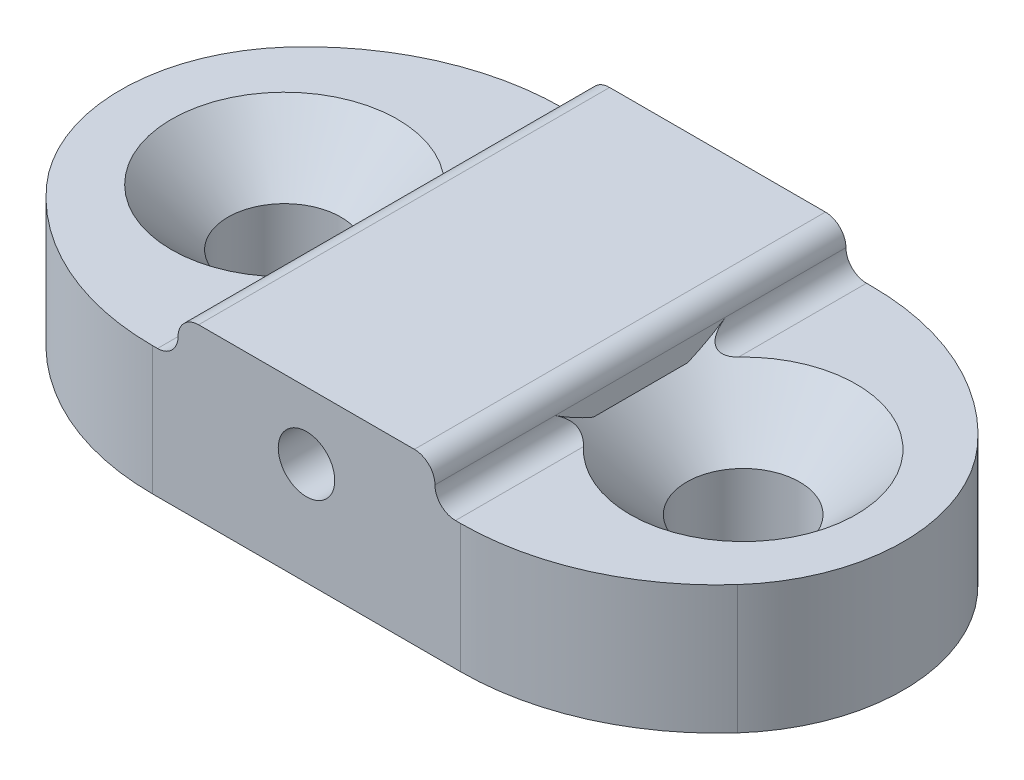
ISO-10303-21;
HEADER;
FILE_DESCRIPTION(('STEP AP214'),'2;1');
FILE_NAME('part.step','',(''),(''),'','','');
FILE_SCHEMA(('AUTOMOTIVE_DESIGN { 1 0 10303 214 1 1 1 1 }'));
ENDSEC;
DATA;
#1=APPLICATION_CONTEXT('core data for automotive mechanical design processes');
#2=APPLICATION_PROTOCOL_DEFINITION('international standard','automotive_design',2000,#1);
#3=PRODUCT_CONTEXT('',#1,'mechanical');
#4=PRODUCT('Part','Part','',(#3));
#5=PRODUCT_RELATED_PRODUCT_CATEGORY('part','',(#4));
#6=PRODUCT_DEFINITION_FORMATION('','',#4);
#7=PRODUCT_DEFINITION_CONTEXT('part definition',#1,'design');
#8=PRODUCT_DEFINITION('design','',#6,#7);
#9=PRODUCT_DEFINITION_SHAPE('','',#8);
#10=(LENGTH_UNIT() NAMED_UNIT(*) SI_UNIT(.MILLI.,.METRE.));
#11=(NAMED_UNIT(*) PLANE_ANGLE_UNIT() SI_UNIT($,.RADIAN.));
#12=(NAMED_UNIT(*) SI_UNIT($,.STERADIAN.) SOLID_ANGLE_UNIT());
#13=UNCERTAINTY_MEASURE_WITH_UNIT(LENGTH_MEASURE(1.E-05),#10,'distance_accuracy_value','');
#14=(GEOMETRIC_REPRESENTATION_CONTEXT(3) GLOBAL_UNCERTAINTY_ASSIGNED_CONTEXT((#13)) GLOBAL_UNIT_ASSIGNED_CONTEXT((#10,
#11,#12)) REPRESENTATION_CONTEXT('',''));
#15=CARTESIAN_POINT('',(0.,0.,0.));
#16=DIRECTION('',(0.,0.,1.));
#17=DIRECTION('',(1.,0.,0.));
#18=AXIS2_PLACEMENT_3D('',#15,#16,#17);
#19=CARTESIAN_POINT('',(0.,2.5,0.));
#20=DIRECTION('',(0.,-1.,0.));
#21=DIRECTION('',(0.,0.,-1.));
#22=AXIS2_PLACEMENT_3D('',#19,#20,#21);
#23=PLANE('',#22);
#24=CARTESIAN_POINT('',(5.,2.5,-3.));
#25=DIRECTION('',(0.,-1.,0.));
#26=DIRECTION('',(0.,0.,-1.));
#27=AXIS2_PLACEMENT_3D('',#24,#25,#26);
#28=CIRCLE('',#27,5.);
#29=CARTESIAN_POINT('',(5.,2.5,-8.));
#30=VERTEX_POINT('',#29);
#31=CARTESIAN_POINT('',(1.27322003750035,2.5,-6.33333333333333));
#32=VERTEX_POINT('',#31);
#33=EDGE_CURVE('E378',#30,#32,#28,.F.);
#34=ORIENTED_EDGE('',*,*,#33,.T.);
#35=CARTESIAN_POINT('',(3.88196601125011,2.5,-4.));
#36=DIRECTION('',(0.,-1.,0.));
#37=DIRECTION('',(0.,0.,-1.));
#38=AXIS2_PLACEMENT_3D('',#35,#36,#37);
#39=CIRCLE('',#38,3.5);
#40=CARTESIAN_POINT('',(1.27322003750035,2.5,-1.66666666666667));
#41=VERTEX_POINT('',#40);
#42=EDGE_CURVE('E383',#32,#41,#39,.F.);
#43=ORIENTED_EDGE('',*,*,#42,.T.);
#44=CARTESIAN_POINT('',(5.,2.5,-5.));
#45=DIRECTION('',(0.,-1.,0.));
#46=DIRECTION('',(0.,0.,-1.));
#47=AXIS2_PLACEMENT_3D('',#44,#45,#46);
#48=CIRCLE('',#47,5.);
#49=CARTESIAN_POINT('',(5.,2.5,0.));
#50=VERTEX_POINT('',#49);
#51=EDGE_CURVE('E376',#41,#50,#48,.F.);
#52=ORIENTED_EDGE('',*,*,#51,.T.);
#53=DIRECTION('',(1.,0.,0.));
#54=VECTOR('',#53,1.);
#55=CARTESIAN_POINT('',(0.,2.5,0.));
#56=LINE('',#55,#54);
#57=CARTESIAN_POINT('',(5.1,2.5,0.));
#58=VERTEX_POINT('',#57);
#59=EDGE_CURVE('E215',#50,#58,#56,.T.);
#60=ORIENTED_EDGE('',*,*,#59,.T.);
#61=DIRECTION('',(0.,0.,1.));
#62=VECTOR('',#61,1.);
#63=CARTESIAN_POINT('',(5.1,2.5,0.));
#64=LINE('',#63,#62);
#65=CARTESIAN_POINT('',(5.1,2.5,-2.41808901716345));
#66=VERTEX_POINT('',#65);
#67=EDGE_CURVE('E266',#58,#66,#64,.F.);
#68=ORIENTED_EDGE('',*,*,#67,.T.);
#69=CARTESIAN_POINT('',(3.57109266389977,2.5,-4.));
#70=DIRECTION('',(0.,1.,0.));
#71=DIRECTION('',(0.,0.,1.));
#72=AXIS2_PLACEMENT_3D('',#69,#70,#71);
#73=CIRCLE('',#72,2.2);
#74=CARTESIAN_POINT('',(5.1,2.5,-5.58191098283655));
#75=VERTEX_POINT('',#74);
#76=EDGE_CURVE('E430',#75,#66,#73,.T.);
#77=ORIENTED_EDGE('',*,*,#76,.F.);
#78=DIRECTION('',(0.,0.,1.));
#79=VECTOR('',#78,1.);
#80=CARTESIAN_POINT('',(5.1,2.5,0.));
#81=LINE('',#80,#79);
#82=CARTESIAN_POINT('',(5.1,2.5,-8.));
#83=VERTEX_POINT('',#82);
#84=EDGE_CURVE('E478',#75,#83,#81,.F.);
#85=ORIENTED_EDGE('',*,*,#84,.T.);
#86=DIRECTION('',(-1.,0.,0.));
#87=VECTOR('',#86,1.);
#88=CARTESIAN_POINT('',(0.,2.5,-8.));
#89=LINE('',#88,#87);
#90=EDGE_CURVE('E217',#83,#30,#89,.T.);
#91=ORIENTED_EDGE('',*,*,#90,.T.);
#92=EDGE_LOOP('',(#34,#43,#52,#60,#68,#77,#85,#91));
#93=FACE_BOUND('',#92,.T.);
#94=ADVANCED_FACE('F33',(#93),#23,.F.);
#95=CARTESIAN_POINT('',(0.,2.5,0.));
#96=DIRECTION('',(0.,0.,-1.));
#97=DIRECTION('',(-1.,0.,0.));
#98=AXIS2_PLACEMENT_3D('',#95,#96,#97);
#99=PLANE('',#98);
#100=CARTESIAN_POINT('',(8.,2.,0.));
#101=DIRECTION('',(0.,0.,-1.));
#102=DIRECTION('',(-1.,0.,0.));
#103=AXIS2_PLACEMENT_3D('',#100,#101,#102);
#104=CIRCLE('',#103,0.55);
#105=CARTESIAN_POINT('',(7.45,2.,0.));
#106=VERTEX_POINT('',#105);
#107=EDGE_CURVE('E204',#106,#106,#104,.T.);
#108=ORIENTED_EDGE('',*,*,#107,.T.);
#109=EDGE_LOOP('',(#108));
#110=FACE_BOUND('',#109,.T.);
#111=DIRECTION('',(1.,0.,0.));
#112=VECTOR('',#111,1.);
#113=CARTESIAN_POINT('',(0.,0.,0.));
#114=LINE('',#113,#112);
#115=CARTESIAN_POINT('',(5.,0.,0.));
#116=VERTEX_POINT('',#115);
#117=CARTESIAN_POINT('',(11.,0.,0.));
#118=VERTEX_POINT('',#117);
#119=EDGE_CURVE('E210',#116,#118,#114,.T.);
#120=ORIENTED_EDGE('',*,*,#119,.T.);
#121=DIRECTION('',(0.,-1.,0.));
#122=VECTOR('',#121,1.);
#123=CARTESIAN_POINT('',(11.,2.5,0.));
#124=LINE('',#123,#122);
#125=CARTESIAN_POINT('',(11.,2.5,0.));
#126=VERTEX_POINT('',#125);
#127=EDGE_CURVE('E371',#118,#126,#124,.F.);
#128=ORIENTED_EDGE('',*,*,#127,.T.);
#129=CARTESIAN_POINT('',(10.9,2.5,0.));
#130=VERTEX_POINT('',#129);
#131=EDGE_CURVE('E218',#130,#126,#56,.T.);
#132=ORIENTED_EDGE('',*,*,#131,.F.);
#133=CARTESIAN_POINT('',(10.9,2.9,0.));
#134=DIRECTION('',(0.,0.,-1.));
#135=DIRECTION('',(-1.,0.,0.));
#136=AXIS2_PLACEMENT_3D('',#133,#134,#135);
#137=CIRCLE('',#136,0.4);
#138=CARTESIAN_POINT('',(10.5,2.9,0.));
#139=VERTEX_POINT('',#138);
#140=EDGE_CURVE('E296',#130,#139,#137,.T.);
#141=ORIENTED_EDGE('',*,*,#140,.T.);
#142=CARTESIAN_POINT('',(10.1,2.9,0.));
#143=DIRECTION('',(0.,0.,-1.));
#144=DIRECTION('',(-1.,0.,0.));
#145=AXIS2_PLACEMENT_3D('',#142,#143,#144);
#146=CIRCLE('',#145,0.4);
#147=CARTESIAN_POINT('',(10.1,3.3,0.));
#148=VERTEX_POINT('',#147);
#149=EDGE_CURVE('E441',#139,#148,#146,.F.);
#150=ORIENTED_EDGE('',*,*,#149,.T.);
#151=DIRECTION('',(-1.,0.,0.));
#152=VECTOR('',#151,1.);
#153=CARTESIAN_POINT('',(5.5,3.3,0.));
#154=LINE('',#153,#152);
#155=CARTESIAN_POINT('',(5.9,3.3,0.));
#156=VERTEX_POINT('',#155);
#157=EDGE_CURVE('E207',#148,#156,#154,.T.);
#158=ORIENTED_EDGE('',*,*,#157,.T.);
#159=CARTESIAN_POINT('',(5.9,2.9,0.));
#160=DIRECTION('',(0.,0.,-1.));
#161=DIRECTION('',(-1.,0.,0.));
#162=AXIS2_PLACEMENT_3D('',#159,#160,#161);
#163=CIRCLE('',#162,0.4);
#164=CARTESIAN_POINT('',(5.5,2.9,0.));
#165=VERTEX_POINT('',#164);
#166=EDGE_CURVE('E448',#156,#165,#163,.F.);
#167=ORIENTED_EDGE('',*,*,#166,.T.);
#168=CARTESIAN_POINT('',(5.1,2.9,0.));
#169=DIRECTION('',(0.,0.,-1.));
#170=DIRECTION('',(-1.,0.,0.));
#171=AXIS2_PLACEMENT_3D('',#168,#169,#170);
#172=CIRCLE('',#171,0.4);
#173=EDGE_CURVE('E295',#165,#58,#172,.T.);
#174=ORIENTED_EDGE('',*,*,#173,.T.);
#175=ORIENTED_EDGE('',*,*,#59,.F.);
#176=DIRECTION('',(0.,-1.,0.));
#177=VECTOR('',#176,1.);
#178=CARTESIAN_POINT('',(5.,2.5,0.));
#179=LINE('',#178,#177);
#180=EDGE_CURVE('E405',#50,#116,#179,.T.);
#181=ORIENTED_EDGE('',*,*,#180,.T.);
#182=EDGE_LOOP('',(#120,#128,#132,#141,#150,#158,#167,#174,#175,#181));
#183=FACE_BOUND('',#182,.T.);
#184=ADVANCED_FACE('F277',(#110,#183),#99,.F.);
#185=CARTESIAN_POINT('',(0.,2.5,-8.));
#186=DIRECTION('',(0.,0.,1.));
#187=DIRECTION('',(1.,0.,0.));
#188=AXIS2_PLACEMENT_3D('',#185,#186,#187);
#189=PLANE('',#188);
#190=CARTESIAN_POINT('',(8.,2.,-8.));
#191=DIRECTION('',(0.,0.,1.));
#192=DIRECTION('',(1.,0.,0.));
#193=AXIS2_PLACEMENT_3D('',#190,#191,#192);
#194=CIRCLE('',#193,0.55);
#195=CARTESIAN_POINT('',(8.55,2.,-8.));
#196=VERTEX_POINT('',#195);
#197=EDGE_CURVE('E201',#196,#196,#194,.T.);
#198=ORIENTED_EDGE('',*,*,#197,.T.);
#199=EDGE_LOOP('',(#198));
#200=FACE_BOUND('',#199,.T.);
#201=CARTESIAN_POINT('',(11.,2.5,-8.));
#202=VERTEX_POINT('',#201);
#203=CARTESIAN_POINT('',(10.9,2.5,-8.));
#204=VERTEX_POINT('',#203);
#205=EDGE_CURVE('E219',#202,#204,#89,.T.);
#206=ORIENTED_EDGE('',*,*,#205,.F.);
#207=DIRECTION('',(0.,-1.,0.));
#208=VECTOR('',#207,1.);
#209=CARTESIAN_POINT('',(11.,2.5,-8.));
#210=LINE('',#209,#208);
#211=CARTESIAN_POINT('',(11.,0.,-8.));
#212=VERTEX_POINT('',#211);
#213=EDGE_CURVE('E369',#202,#212,#210,.T.);
#214=ORIENTED_EDGE('',*,*,#213,.T.);
#215=DIRECTION('',(-1.,0.,0.));
#216=VECTOR('',#215,1.);
#217=CARTESIAN_POINT('',(0.,0.,-8.));
#218=LINE('',#217,#216);
#219=CARTESIAN_POINT('',(5.,0.,-8.));
#220=VERTEX_POINT('',#219);
#221=EDGE_CURVE('E224',#212,#220,#218,.T.);
#222=ORIENTED_EDGE('',*,*,#221,.T.);
#223=DIRECTION('',(0.,-1.,0.));
#224=VECTOR('',#223,1.);
#225=CARTESIAN_POINT('',(5.,2.5,-8.));
#226=LINE('',#225,#224);
#227=EDGE_CURVE('E365',#220,#30,#226,.F.);
#228=ORIENTED_EDGE('',*,*,#227,.T.);
#229=ORIENTED_EDGE('',*,*,#90,.F.);
#230=CARTESIAN_POINT('',(5.1,2.9,-8.));
#231=DIRECTION('',(0.,0.,1.));
#232=DIRECTION('',(1.,0.,0.));
#233=AXIS2_PLACEMENT_3D('',#230,#231,#232);
#234=CIRCLE('',#233,0.4);
#235=CARTESIAN_POINT('',(5.5,2.9,-8.));
#236=VERTEX_POINT('',#235);
#237=EDGE_CURVE('E418',#83,#236,#234,.T.);
#238=ORIENTED_EDGE('',*,*,#237,.T.);
#239=CARTESIAN_POINT('',(5.9,2.9,-8.));
#240=DIRECTION('',(0.,0.,1.));
#241=DIRECTION('',(1.,0.,0.));
#242=AXIS2_PLACEMENT_3D('',#239,#240,#241);
#243=CIRCLE('',#242,0.4);
#244=CARTESIAN_POINT('',(5.9,3.3,-8.));
#245=VERTEX_POINT('',#244);
#246=EDGE_CURVE('E456',#236,#245,#243,.F.);
#247=ORIENTED_EDGE('',*,*,#246,.T.);
#248=DIRECTION('',(1.,0.,0.));
#249=VECTOR('',#248,1.);
#250=CARTESIAN_POINT('',(5.5,3.3,-8.));
#251=LINE('',#250,#249);
#252=CARTESIAN_POINT('',(10.1,3.3,-8.));
#253=VERTEX_POINT('',#252);
#254=EDGE_CURVE('E184',#245,#253,#251,.T.);
#255=ORIENTED_EDGE('',*,*,#254,.T.);
#256=CARTESIAN_POINT('',(10.1,2.9,-8.));
#257=DIRECTION('',(0.,0.,1.));
#258=DIRECTION('',(1.,0.,0.));
#259=AXIS2_PLACEMENT_3D('',#256,#257,#258);
#260=CIRCLE('',#259,0.4);
#261=CARTESIAN_POINT('',(10.5,2.9,-8.));
#262=VERTEX_POINT('',#261);
#263=EDGE_CURVE('E438',#253,#262,#260,.F.);
#264=ORIENTED_EDGE('',*,*,#263,.T.);
#265=CARTESIAN_POINT('',(10.9,2.9,-8.));
#266=DIRECTION('',(0.,0.,1.));
#267=DIRECTION('',(1.,0.,0.));
#268=AXIS2_PLACEMENT_3D('',#265,#266,#267);
#269=CIRCLE('',#268,0.4);
#270=EDGE_CURVE('E265',#262,#204,#269,.T.);
#271=ORIENTED_EDGE('',*,*,#270,.T.);
#272=EDGE_LOOP('',(#206,#214,#222,#228,#229,#238,#247,#255,#264,#271));
#273=FACE_BOUND('',#272,.T.);
#274=ADVANCED_FACE('F347',(#200,#273),#189,.F.);
#275=CARTESIAN_POINT('',(11.,2.5,-5.));
#276=DIRECTION('',(0.,-1.,0.));
#277=DIRECTION('',(0.,0.,-1.));
#278=AXIS2_PLACEMENT_3D('',#275,#276,#277);
#279=CIRCLE('',#278,5.);
#280=CARTESIAN_POINT('',(14.7267799624996,2.5,-1.66666666666667));
#281=VERTEX_POINT('',#280);
#282=EDGE_CURVE('E361',#126,#281,#279,.F.);
#283=ORIENTED_EDGE('',*,*,#282,.T.);
#284=CARTESIAN_POINT('',(12.1180339887499,2.5,-4.));
#285=DIRECTION('',(0.,-1.,0.));
#286=DIRECTION('',(0.,0.,-1.));
#287=AXIS2_PLACEMENT_3D('',#284,#285,#286);
#288=CIRCLE('',#287,3.5);
#289=CARTESIAN_POINT('',(14.7267799624996,2.5,-6.33333333333333));
#290=VERTEX_POINT('',#289);
#291=EDGE_CURVE('E41',#281,#290,#288,.F.);
#292=ORIENTED_EDGE('',*,*,#291,.T.);
#293=CARTESIAN_POINT('',(11.,2.5,-3.));
#294=DIRECTION('',(0.,-1.,0.));
#295=DIRECTION('',(0.,0.,-1.));
#296=AXIS2_PLACEMENT_3D('',#293,#294,#295);
#297=CIRCLE('',#296,5.);
#298=EDGE_CURVE('E366',#290,#202,#297,.F.);
#299=ORIENTED_EDGE('',*,*,#298,.T.);
#300=ORIENTED_EDGE('',*,*,#205,.T.);
#301=DIRECTION('',(0.,0.,1.));
#302=VECTOR('',#301,1.);
#303=CARTESIAN_POINT('',(10.9,2.5,0.));
#304=LINE('',#303,#302);
#305=CARTESIAN_POINT('',(10.9,2.5,-5.50996688705415));
#306=VERTEX_POINT('',#305);
#307=EDGE_CURVE('E228',#204,#306,#304,.T.);
#308=ORIENTED_EDGE('',*,*,#307,.T.);
#309=CARTESIAN_POINT('',(12.5,2.5,-4.));
#310=DIRECTION('',(0.,1.,0.));
#311=DIRECTION('',(0.,0.,1.));
#312=AXIS2_PLACEMENT_3D('',#309,#310,#311);
#313=CIRCLE('',#312,2.2);
#314=CARTESIAN_POINT('',(10.9,2.5,-2.49003311294585));
#315=VERTEX_POINT('',#314);
#316=EDGE_CURVE('E189',#315,#306,#313,.T.);
#317=ORIENTED_EDGE('',*,*,#316,.F.);
#318=DIRECTION('',(0.,0.,1.));
#319=VECTOR('',#318,1.);
#320=CARTESIAN_POINT('',(10.9,2.5,0.));
#321=LINE('',#320,#319);
#322=EDGE_CURVE('E221',#315,#130,#321,.T.);
#323=ORIENTED_EDGE('',*,*,#322,.T.);
#324=ORIENTED_EDGE('',*,*,#131,.T.);
#325=EDGE_LOOP('',(#283,#292,#299,#300,#308,#317,#323,#324));
#326=FACE_BOUND('',#325,.T.);
#327=ADVANCED_FACE('F343',(#326),#23,.F.);
#328=CARTESIAN_POINT('',(0.,0.,0.));
#329=DIRECTION('',(0.,-1.,0.));
#330=DIRECTION('',(0.,0.,-1.));
#331=AXIS2_PLACEMENT_3D('',#328,#329,#330);
#332=PLANE('',#331);
#333=CARTESIAN_POINT('',(3.57109266389977,0.,-4.));
#334=DIRECTION('',(0.,1.,0.));
#335=DIRECTION('',(0.,0.,1.));
#336=AXIS2_PLACEMENT_3D('',#333,#334,#335);
#337=CIRCLE('',#336,1.1);
#338=CARTESIAN_POINT('',(3.57109266389977,0.,-2.9));
#339=VERTEX_POINT('',#338);
#340=EDGE_CURVE('E195',#339,#339,#337,.T.);
#341=ORIENTED_EDGE('',*,*,#340,.T.);
#342=EDGE_LOOP('',(#341));
#343=FACE_BOUND('',#342,.T.);
#344=CARTESIAN_POINT('',(12.5,0.,-4.));
#345=DIRECTION('',(0.,1.,0.));
#346=DIRECTION('',(0.,0.,1.));
#347=AXIS2_PLACEMENT_3D('',#344,#345,#346);
#348=CIRCLE('',#347,1.1);
#349=CARTESIAN_POINT('',(12.5,0.,-2.9));
#350=VERTEX_POINT('',#349);
#351=EDGE_CURVE('E192',#350,#350,#348,.T.);
#352=ORIENTED_EDGE('',*,*,#351,.T.);
#353=EDGE_LOOP('',(#352));
#354=FACE_BOUND('',#353,.T.);
#355=CARTESIAN_POINT('',(5.,0.,-5.));
#356=DIRECTION('',(0.,-1.,0.));
#357=DIRECTION('',(0.,0.,-1.));
#358=AXIS2_PLACEMENT_3D('',#355,#356,#357);
#359=CIRCLE('',#358,5.);
#360=CARTESIAN_POINT('',(1.27322003750035,0.,-1.66666666666667));
#361=VERTEX_POINT('',#360);
#362=EDGE_CURVE('E407',#116,#361,#359,.T.);
#363=ORIENTED_EDGE('',*,*,#362,.T.);
#364=CARTESIAN_POINT('',(3.88196601125011,0.,-4.));
#365=DIRECTION('',(0.,-1.,0.));
#366=DIRECTION('',(0.,0.,-1.));
#367=AXIS2_PLACEMENT_3D('',#364,#365,#366);
#368=CIRCLE('',#367,3.5);
#369=CARTESIAN_POINT('',(1.27322003750035,0.,-6.33333333333333));
#370=VERTEX_POINT('',#369);
#371=EDGE_CURVE('E389',#361,#370,#368,.T.);
#372=ORIENTED_EDGE('',*,*,#371,.T.);
#373=CARTESIAN_POINT('',(5.,0.,-3.));
#374=DIRECTION('',(0.,-1.,0.));
#375=DIRECTION('',(0.,0.,-1.));
#376=AXIS2_PLACEMENT_3D('',#373,#374,#375);
#377=CIRCLE('',#376,5.);
#378=EDGE_CURVE('E403',#370,#220,#377,.T.);
#379=ORIENTED_EDGE('',*,*,#378,.T.);
#380=ORIENTED_EDGE('',*,*,#221,.F.);
#381=CARTESIAN_POINT('',(11.,0.,-3.));
#382=DIRECTION('',(0.,-1.,0.));
#383=DIRECTION('',(0.,0.,-1.));
#384=AXIS2_PLACEMENT_3D('',#381,#382,#383);
#385=CIRCLE('',#384,5.);
#386=CARTESIAN_POINT('',(14.7267799624996,0.,-6.33333333333333));
#387=VERTEX_POINT('',#386);
#388=EDGE_CURVE('E401',#212,#387,#385,.T.);
#389=ORIENTED_EDGE('',*,*,#388,.T.);
#390=CARTESIAN_POINT('',(12.1180339887499,0.,-4.));
#391=DIRECTION('',(0.,-1.,0.));
#392=DIRECTION('',(0.,0.,-1.));
#393=AXIS2_PLACEMENT_3D('',#390,#391,#392);
#394=CIRCLE('',#393,3.5);
#395=CARTESIAN_POINT('',(14.7267799624996,0.,-1.66666666666667));
#396=VERTEX_POINT('',#395);
#397=EDGE_CURVE('E387',#387,#396,#394,.T.);
#398=ORIENTED_EDGE('',*,*,#397,.T.);
#399=CARTESIAN_POINT('',(11.,0.,-5.));
#400=DIRECTION('',(0.,-1.,0.));
#401=DIRECTION('',(0.,0.,-1.));
#402=AXIS2_PLACEMENT_3D('',#399,#400,#401);
#403=CIRCLE('',#402,5.);
#404=EDGE_CURVE('E393',#396,#118,#403,.T.);
#405=ORIENTED_EDGE('',*,*,#404,.T.);
#406=ORIENTED_EDGE('',*,*,#119,.F.);
#407=EDGE_LOOP('',(#363,#372,#379,#380,#389,#398,#405,#406));
#408=FACE_BOUND('',#407,.T.);
#409=ADVANCED_FACE('F352',(#343,#354,#408),#332,.T.);
#410=CARTESIAN_POINT('',(5.5,2.5,-13.0635955604689));
#411=DIRECTION('',(-1.,0.,0.));
#412=DIRECTION('',(0.,-1.,0.));
#413=AXIS2_PLACEMENT_3D('',#410,#411,#412);
#414=PLANE('',#413);
#415=DIRECTION('',(0.,0.,1.));
#416=VECTOR('',#415,1.);
#417=CARTESIAN_POINT('',(5.5,2.5,-13.0635955604689));
#418=LINE('',#417,#416);
#419=CARTESIAN_POINT('',(5.5,2.5,-5.05797754642463));
#420=VERTEX_POINT('',#419);
#421=CARTESIAN_POINT('',(5.5,2.5,-2.94202245357536));
#422=VERTEX_POINT('',#421);
#423=EDGE_CURVE('E185',#420,#422,#418,.T.);
#424=ORIENTED_EDGE('',*,*,#423,.T.);
#425=CARTESIAN_POINT('',(5.5,2.5,-2.94202245357536));
#426=CARTESIAN_POINT('',(5.5,2.52872917775644,-2.8823228496387));
#427=CARTESIAN_POINT('',(5.5,2.55893294478922,-2.82335937948788));
#428=CARTESIAN_POINT('',(5.5,2.62175738827018,-2.70682487240755));
#429=CARTESIAN_POINT('',(5.5,2.6543750152887,-2.64925219651247));
#430=CARTESIAN_POINT('',(5.5,2.72155791669848,-2.53529023365637));
#431=CARTESIAN_POINT('',(5.5,2.75612255971361,-2.47890057111754));
#432=CARTESIAN_POINT('',(5.5,2.82691084229986,-2.36707219379437));
#433=CARTESIAN_POINT('',(5.5,2.86313648702678,-2.31163474568505));
#434=CARTESIAN_POINT('',(5.5,2.90000000000016,-2.25663644389946));
#435=B_SPLINE_CURVE_WITH_KNOTS('',3,(#425,#426,#427,#428,#429,#430,#431,#432,#433,#434),
.UNSPECIFIED.,.F.,.F.,(4,2,2,2,4),(0.,0.198703135537779,0.397159399098888,0.595551673880541,
0.794190099681815),.UNSPECIFIED.);
#436=CARTESIAN_POINT('',(5.5,2.9,-2.25663644389938));
#437=VERTEX_POINT('',#436);
#438=EDGE_CURVE('E473',#422,#437,#435,.T.);
#439=ORIENTED_EDGE('',*,*,#438,.T.);
#440=DIRECTION('',(0.,0.,1.));
#441=VECTOR('',#440,1.);
#442=CARTESIAN_POINT('',(5.5,2.9,-13.0635955604689));
#443=LINE('',#442,#441);
#444=CARTESIAN_POINT('',(5.5,2.9,-5.74336355610062));
#445=VERTEX_POINT('',#444);
#446=EDGE_CURVE('E467',#437,#445,#443,.F.);
#447=ORIENTED_EDGE('',*,*,#446,.T.);
#448=CARTESIAN_POINT('',(5.5,2.9,-5.74336355610062));
#449=CARTESIAN_POINT('',(5.5,2.86313648702672,-5.68836525431496));
#450=CARTESIAN_POINT('',(5.5,2.82691084229984,-5.63292780620562));
#451=CARTESIAN_POINT('',(5.5,2.75612255971362,-5.52109942888244));
#452=CARTESIAN_POINT('',(5.5,2.72155791669848,-5.46470976634362));
#453=CARTESIAN_POINT('',(5.5,2.65437501528869,-5.35074780348753));
#454=CARTESIAN_POINT('',(5.5,2.62175738827018,-5.29317512759244));
#455=CARTESIAN_POINT('',(5.5,2.55893294478922,-5.17664062051212));
#456=CARTESIAN_POINT('',(5.5,2.52872917775644,-5.11767715036129));
#457=CARTESIAN_POINT('',(5.5,2.5,-5.05797754642463));
#458=B_SPLINE_CURVE_WITH_KNOTS('',3,(#448,#449,#450,#451,#452,#453,#454,#455,#456,#457),
.UNSPECIFIED.,.F.,.F.,(4,2,2,2,4),(0.,0.198638425801267,0.397030700582914,0.595486964144023,
0.794190099681799),.UNSPECIFIED.);
#459=EDGE_CURVE('E462',#445,#420,#458,.T.);
#460=ORIENTED_EDGE('',*,*,#459,.T.);
#461=EDGE_LOOP('',(#424,#439,#447,#460));
#462=FACE_BOUND('',#461,.T.);
#463=ADVANCED_FACE('F357',(#462),#414,.T.);
#464=CARTESIAN_POINT('',(5.5,3.3,-13.0635955604689));
#465=DIRECTION('',(0.,1.,0.));
#466=DIRECTION('',(-1.,0.,0.));
#467=AXIS2_PLACEMENT_3D('',#464,#465,#466);
#468=PLANE('',#467);
#469=ORIENTED_EDGE('',*,*,#157,.F.);
#470=DIRECTION('',(0.,0.,1.));
#471=VECTOR('',#470,1.);
#472=CARTESIAN_POINT('',(10.1,3.3,-13.0635955604689));
#473=LINE('',#472,#471);
#474=EDGE_CURVE('E454',#148,#253,#473,.F.);
#475=ORIENTED_EDGE('',*,*,#474,.T.);
#476=ORIENTED_EDGE('',*,*,#254,.F.);
#477=DIRECTION('',(0.,0.,1.));
#478=VECTOR('',#477,1.);
#479=CARTESIAN_POINT('',(5.9,3.3,-13.0635955604689));
#480=LINE('',#479,#478);
#481=EDGE_CURVE('E447',#245,#156,#480,.T.);
#482=ORIENTED_EDGE('',*,*,#481,.T.);
#483=EDGE_LOOP('',(#469,#475,#476,#482));
#484=FACE_BOUND('',#483,.T.);
#485=ADVANCED_FACE('F452',(#484),#468,.T.);
#486=CARTESIAN_POINT('',(10.5,2.5,-13.0635955604689));
#487=DIRECTION('',(1.,0.,0.));
#488=DIRECTION('',(0.,1.,0.));
#489=AXIS2_PLACEMENT_3D('',#486,#487,#488);
#490=PLANE('',#489);
#491=DIRECTION('',(0.,0.,1.));
#492=VECTOR('',#491,1.);
#493=CARTESIAN_POINT('',(10.5,2.5,-13.0635955604689));
#494=LINE('',#493,#492);
#495=CARTESIAN_POINT('',(10.5,2.5,-4.91651513899117));
#496=VERTEX_POINT('',#495);
#497=CARTESIAN_POINT('',(10.5,2.5,-3.08348486100883));
#498=VERTEX_POINT('',#497);
#499=EDGE_CURVE('E172',#496,#498,#494,.T.);
#500=ORIENTED_EDGE('',*,*,#499,.F.);
#501=CARTESIAN_POINT('',(10.5,2.5,-4.91651513899117));
#502=CARTESIAN_POINT('',(10.5,2.52718727449056,-4.98172105472955));
#503=CARTESIAN_POINT('',(10.5,2.55636217171402,-5.04605522553401));
#504=CARTESIAN_POINT('',(10.5,2.61794446605888,-5.17301690717014));
#505=CARTESIAN_POINT('',(10.5,2.65034577979058,-5.23564735663984));
#506=CARTESIAN_POINT('',(10.5,2.71772744515605,-5.35944845668018));
#507=CARTESIAN_POINT('',(10.5,2.75270653042835,-5.42061980475769));
#508=CARTESIAN_POINT('',(10.5,2.82484715782165,-5.54181848776246));
#509=CARTESIAN_POINT('',(10.5,2.86201261655119,-5.60184349772124));
#510=CARTESIAN_POINT('',(10.5,2.9,-5.66132477258362));
#511=B_SPLINE_CURVE_WITH_KNOTS('',3,(#501,#502,#503,#504,#505,#506,#507,#508,#509,#510),
.UNSPECIFIED.,.F.,.F.,(4,2,2,2,4),(0.,0.211850082373243,0.423308025594081,0.634662771281034,
0.846408397578634),.UNSPECIFIED.);
#512=CARTESIAN_POINT('',(10.5,2.9,-5.66132477258362));
#513=VERTEX_POINT('',#512);
#514=EDGE_CURVE('E179',#496,#513,#511,.T.);
#515=ORIENTED_EDGE('',*,*,#514,.T.);
#516=DIRECTION('',(0.,0.,1.));
#517=VECTOR('',#516,1.);
#518=CARTESIAN_POINT('',(10.5,2.9,-13.0635955604689));
#519=LINE('',#518,#517);
#520=CARTESIAN_POINT('',(10.5,2.9,-2.33867522741638));
#521=VERTEX_POINT('',#520);
#522=EDGE_CURVE('E175',#513,#521,#519,.T.);
#523=ORIENTED_EDGE('',*,*,#522,.T.);
#524=CARTESIAN_POINT('',(10.5,2.9,-2.33867522741638));
#525=CARTESIAN_POINT('',(10.5,2.86201261655119,-2.39815650227876));
#526=CARTESIAN_POINT('',(10.5,2.82484715782165,-2.45818151223754));
#527=CARTESIAN_POINT('',(10.5,2.75270653042835,-2.57938019524231));
#528=CARTESIAN_POINT('',(10.5,2.71772744515605,-2.64055154331981));
#529=CARTESIAN_POINT('',(10.5,2.65034577979058,-2.76435264336016));
#530=CARTESIAN_POINT('',(10.5,2.61794446605888,-2.82698309282986));
#531=CARTESIAN_POINT('',(10.5,2.55636217171402,-2.95394477446599));
#532=CARTESIAN_POINT('',(10.5,2.52718727449056,-3.01827894527045));
#533=CARTESIAN_POINT('',(10.5,2.5,-3.08348486100883));
#534=B_SPLINE_CURVE_WITH_KNOTS('',3,(#524,#525,#526,#527,#528,#529,#530,#531,#532,#533),
.UNSPECIFIED.,.F.,.F.,(4,2,2,2,4),(0.,0.211745626297599,0.423100371984552,0.634558315205388,
0.846408397578631),.UNSPECIFIED.);
#535=EDGE_CURVE('E168',#521,#498,#534,.T.);
#536=ORIENTED_EDGE('',*,*,#535,.T.);
#537=EDGE_LOOP('',(#500,#515,#523,#536));
#538=FACE_BOUND('',#537,.T.);
#539=ADVANCED_FACE('F170',(#538),#490,.T.);
#540=CARTESIAN_POINT('',(8.,2.,-8.));
#541=DIRECTION('',(0.,0.,1.));
#542=DIRECTION('',(1.,0.,0.));
#543=AXIS2_PLACEMENT_3D('',#540,#541,#542);
#544=CYLINDRICAL_SURFACE('',#543,0.55);
#545=ORIENTED_EDGE('',*,*,#197,.F.);
#546=EDGE_LOOP('',(#545));
#547=FACE_BOUND('',#546,.T.);
#548=ORIENTED_EDGE('',*,*,#107,.F.);
#549=EDGE_LOOP('',(#548));
#550=FACE_BOUND('',#549,.T.);
#551=ADVANCED_FACE('F615',(#547,#550),#544,.F.);
#552=CARTESIAN_POINT('',(14.7,2.5,-4.));
#553=DIRECTION('',(0.,1.,0.));
#554=DIRECTION('',(0.,0.,1.));
#555=AXIS2_PLACEMENT_3D('',#552,#553,#554);
#556=PLANE('',#555);
#557=ORIENTED_EDGE('',*,*,#499,.T.);
#558=EDGE_CURVE('E183',#496,#498,#313,.T.);
#559=ORIENTED_EDGE('',*,*,#558,.F.);
#560=EDGE_LOOP('',(#557,#559));
#561=FACE_BOUND('',#560,.T.);
#562=ADVANCED_FACE('F182',(#561),#556,.F.);
#563=CARTESIAN_POINT('',(12.5,2.5,-4.));
#564=DIRECTION('',(0.,1.,0.));
#565=DIRECTION('',(0.,0.,1.));
#566=AXIS2_PLACEMENT_3D('',#563,#564,#565);
#567=CYLINDRICAL_SURFACE('',#566,1.1);
#568=ORIENTED_EDGE('',*,*,#351,.F.);
#569=EDGE_LOOP('',(#568));
#570=FACE_BOUND('',#569,.T.);
#571=CARTESIAN_POINT('',(12.5,1.4,-4.));
#572=DIRECTION('',(0.,1.,0.));
#573=DIRECTION('',(0.,0.,1.));
#574=AXIS2_PLACEMENT_3D('',#571,#572,#573);
#575=CIRCLE('',#574,1.1);
#576=CARTESIAN_POINT('',(12.5,1.4,-2.9));
#577=VERTEX_POINT('',#576);
#578=EDGE_CURVE('E188',#577,#577,#575,.T.);
#579=ORIENTED_EDGE('',*,*,#578,.T.);
#580=EDGE_LOOP('',(#579));
#581=FACE_BOUND('',#580,.T.);
#582=ADVANCED_FACE('F249',(#570,#581),#567,.F.);
#583=CARTESIAN_POINT('',(12.5,2.5,-4.));
#584=DIRECTION('',(0.,1.,0.));
#585=DIRECTION('',(0.,0.,1.));
#586=AXIS2_PLACEMENT_3D('',#583,#584,#585);
#587=CONICAL_SURFACE('',#586,2.2,0.785398163397448);
#588=ORIENTED_EDGE('',*,*,#578,.F.);
#589=EDGE_LOOP('',(#588));
#590=FACE_BOUND('',#589,.T.);
#591=ORIENTED_EDGE('',*,*,#558,.T.);
#592=ORIENTED_EDGE('',*,*,#535,.F.);
#593=CARTESIAN_POINT('',(10.5,2.9,-2.33867522741638));
#594=CARTESIAN_POINT('',(10.5000082115001,2.88928184889667,-2.35543698650999));
#595=CARTESIAN_POINT('',(10.5004313809724,2.87840196629674,-2.37210715317471));
#596=CARTESIAN_POINT('',(10.5022445597365,2.85621944205861,-2.40520183485895));
#597=CARTESIAN_POINT('',(10.5036382940098,2.84491533092787,-2.42162515356213));
#598=CARTESIAN_POINT('',(10.5075543072099,2.82173213370308,-2.45422182633193));
#599=CARTESIAN_POINT('',(10.5100895929725,2.80984786962051,-2.47039001129779));
#600=CARTESIAN_POINT('',(10.51651299931,2.78556364454504,-2.5020285714298));
#601=CARTESIAN_POINT('',(10.5203987895313,2.77316460406493,-2.51750009709939));
#602=CARTESIAN_POINT('',(10.5286496397397,2.75100210123375,-2.54355370103504));
#603=CARTESIAN_POINT('',(10.5326361853925,2.74137826352862,-2.55437210633327));
#604=CARTESIAN_POINT('',(10.5417500176447,2.72174695607069,-2.57516743955946));
#605=CARTESIAN_POINT('',(10.5468773942677,2.7117394560945,-2.58514430099501));
#606=CARTESIAN_POINT('',(10.558605701714,2.69121356762825,-2.60396690067398));
#607=CARTESIAN_POINT('',(10.5652248310792,2.6806902459439,-2.61279634271062));
#608=CARTESIAN_POINT('',(10.5801917406879,2.65939612437952,-2.62847108877861));
#609=CARTESIAN_POINT('',(10.5885330179989,2.64862638721869,-2.63532363084752));
#610=CARTESIAN_POINT('',(10.6039128580293,2.63089174530198,-2.64430467375412));
#611=CARTESIAN_POINT('',(10.6104226849201,2.62388415559201,-2.64724728385563));
#612=CARTESIAN_POINT('',(10.6241861626942,2.6101362992266,-2.65164645237734));
#613=CARTESIAN_POINT('',(10.631439107581,2.60339578712653,-2.65310440714174));
#614=CARTESIAN_POINT('',(10.6465319866877,2.59039812427842,-2.65441656338548));
#615=CARTESIAN_POINT('',(10.6543732135156,2.58414210318983,-2.65426712405161));
#616=CARTESIAN_POINT('',(10.6703845377211,2.57231706245705,-2.65242365793966));
#617=CARTESIAN_POINT('',(10.6785549020436,2.5667486159744,-2.65072835226743));
#618=CARTESIAN_POINT('',(10.6972460533728,2.55497250694134,-2.64535849488883));
#619=CARTESIAN_POINT('',(10.707798170129,2.54900694770339,-2.64126925884805));
#620=CARTESIAN_POINT('',(10.728770642434,2.53830954920871,-2.63146699880835));
#621=CARTESIAN_POINT('',(10.7391906308501,2.53358063671031,-2.62575018839405));
#622=CARTESIAN_POINT('',(10.7662465349036,2.52258988500056,-2.60919376397902));
#623=CARTESIAN_POINT('',(10.7826588204232,2.51724174862954,-2.59739698155804));
#624=CARTESIAN_POINT('',(10.8146774305171,2.50885424647161,-2.57201912184637));
#625=CARTESIAN_POINT('',(10.8302809080553,2.50582258000457,-2.55843226873657));
#626=CARTESIAN_POINT('',(10.8548997267719,2.50243789828712,-2.53557481421081));
#627=CARTESIAN_POINT('',(10.8641550906149,2.50150404996848,-2.52663773825739));
#628=CARTESIAN_POINT('',(10.8823144621081,2.50028889474641,-2.50851475190431));
#629=CARTESIAN_POINT('',(10.8912207125452,2.50000235071077,-2.49933145134352));
#630=CARTESIAN_POINT('',(10.9000000000022,2.4999999999963,-2.4900331129488));
#631=B_SPLINE_CURVE_WITH_KNOTS('',3,(#593,#594,#595,#596,#597,#598,#599,#600,#601,#602,#603,
#604,#605,#606,#607,#608,#609,#610,#611,#612,#613,#614,#615,#616,#617,#618,#619,#620,#621,#622,
#623,#624,#625,#626,#627,#628,#629,#630),.UNSPECIFIED.,.F.,.F.,(4,2,2,2,2,2,2,2,2,2,2,2,2,2,2,2,
2,2,4),(0.,0.0596969180766527,0.11962422194845,0.180252328134847,0.240776333102284,
0.28577772363877,0.330782666519028,0.37636961413138,0.421787471830136,0.451686511017579,
0.481557403592906,0.511495969180006,0.54145932541542,0.579622595075581,0.617875384227349,
0.680249383347249,0.742829805667948,0.781507751006251,0.819871627262304),.UNSPECIFIED.);
#632=EDGE_CURVE('E290',#521,#315,#631,.T.);
#633=ORIENTED_EDGE('',*,*,#632,.T.);
#634=ORIENTED_EDGE('',*,*,#316,.T.);
#635=CARTESIAN_POINT('',(10.9,2.5,-5.50996688705415));
#636=CARTESIAN_POINT('',(10.89095148795,2.50000278412556,-5.5003824739581));
#637=CARTESIAN_POINT('',(10.8817755963747,2.50030660862329,-5.49092934625797));
#638=CARTESIAN_POINT('',(10.8630999130022,2.50159484214976,-5.47232915485972));
#639=CARTESIAN_POINT('',(10.8535990654736,2.50258172002601,-5.46318332802342));
#640=CARTESIAN_POINT('',(10.8242887363401,2.50672734012162,-5.43608411646345));
#641=CARTESIAN_POINT('',(10.8039659307153,2.51107649227757,-5.41878895375473));
#642=CARTESIAN_POINT('',(10.7726866125124,2.52065052885067,-5.39564826732727));
#643=CARTESIAN_POINT('',(10.7622389187228,2.52429773124547,-5.38846171783246));
#644=CARTESIAN_POINT('',(10.7410766118703,2.53274982918775,-5.37531661793096));
#645=CARTESIAN_POINT('',(10.7303631657617,2.53755026668816,-5.36935349881667));
#646=CARTESIAN_POINT('',(10.7104842940797,2.54759787445383,-5.35993023281932));
#647=CARTESIAN_POINT('',(10.7013419683236,2.5526543700821,-5.35622340013142));
#648=CARTESIAN_POINT('',(10.6831307328907,2.56372507370143,-5.35036959346878));
#649=CARTESIAN_POINT('',(10.6740617561525,2.56973826955585,-5.34822098418426));
#650=CARTESIAN_POINT('',(10.6562050048475,2.58268880949329,-5.34578166531657));
#651=CARTESIAN_POINT('',(10.647420373576,2.58963375793891,-5.34550732699135));
#652=CARTESIAN_POINT('',(10.6305632793084,2.60414933909905,-5.34697061605468));
#653=CARTESIAN_POINT('',(10.6224909141937,2.61172005753246,-5.3487085195086));
#654=CARTESIAN_POINT('',(10.6083107897731,2.62612764168212,-5.35365630510975));
#655=CARTESIAN_POINT('',(10.6020844477334,2.63292877796882,-5.35664056082613));
#656=CARTESIAN_POINT('',(10.5903916684481,2.64657652404887,-5.36375127601687));
#657=CARTESIAN_POINT('',(10.5849254233283,2.65342314488256,-5.36787802348754));
#658=CARTESIAN_POINT('',(10.57105906742,2.6719382669796,-5.38031879447169));
#659=CARTESIAN_POINT('',(10.5633675664334,2.68354219051667,-5.38951285400012));
#660=CARTESIAN_POINT('',(10.5497640418162,2.70632147287976,-5.40960272355589));
#661=CARTESIAN_POINT('',(10.5438589850982,2.7174950091924,-5.42050495074448));
#662=CARTESIAN_POINT('',(10.5285457018978,2.74972788854458,-5.4541923302043));
#663=CARTESIAN_POINT('',(10.5211059185057,2.77014289234727,-5.47846453245346));
#664=CARTESIAN_POINT('',(10.5098205743706,2.80957111026032,-5.52886103478543));
#665=CARTESIAN_POINT('',(10.505984837035,2.82858036376107,-5.55499018925042));
#666=CARTESIAN_POINT('',(10.5023065370367,2.85614409950149,-5.59473671398908));
#667=CARTESIAN_POINT('',(10.5014254087938,2.86511297140259,-5.60798129228236));
#668=CARTESIAN_POINT('',(10.5002749762774,2.88275517540316,-5.63457119722973));
#669=CARTESIAN_POINT('',(10.5000018127919,2.89143002545175,-5.64791534574849));
#670=CARTESIAN_POINT('',(10.4999999999999,2.89999999999975,-5.66132477258378));
#671=B_SPLINE_CURVE_WITH_KNOTS('',3,(#635,#636,#637,#638,#639,#640,#641,#642,#643,#644,#645,
#646,#647,#648,#649,#650,#651,#652,#653,#654,#655,#656,#657,#658,#659,#660,#661,#662,#663,#664,
#665,#666,#667,#668,#669,#670),.UNSPECIFIED.,.F.,.F.,(4,2,2,2,2,2,2,2,2,2,2,2,2,2,2,2,2,4),(0.,
0.0395185015250118,0.0791805908923919,0.159801891436203,0.199308695045002,0.238665167922435,
0.271798254220734,0.304896517797985,0.338283520397399,0.371675104000363,0.400640951860443,
0.429614108014082,0.479373150729277,0.529323817648211,0.626514212822978,0.723968754074214,
0.772015281860424,0.819755941512631),.UNSPECIFIED.);
#672=EDGE_CURVE('E258',#306,#513,#671,.T.);
#673=ORIENTED_EDGE('',*,*,#672,.T.);
#674=ORIENTED_EDGE('',*,*,#514,.F.);
#675=EDGE_LOOP('',(#591,#592,#633,#634,#673,#674));
#676=FACE_BOUND('',#675,.T.);
#677=ADVANCED_FACE('F187',(#590,#676),#587,.F.);
#678=CARTESIAN_POINT('',(5.77109266389977,2.5,-4.));
#679=DIRECTION('',(0.,1.,0.));
#680=DIRECTION('',(0.,0.,1.));
#681=AXIS2_PLACEMENT_3D('',#678,#679,#680);
#682=PLANE('',#681);
#683=ORIENTED_EDGE('',*,*,#423,.F.);
#684=EDGE_CURVE('E490',#422,#420,#73,.T.);
#685=ORIENTED_EDGE('',*,*,#684,.F.);
#686=EDGE_LOOP('',(#683,#685));
#687=FACE_BOUND('',#686,.T.);
#688=ADVANCED_FACE('F248',(#687),#682,.F.);
#689=CARTESIAN_POINT('',(3.57109266389977,2.5,-4.));
#690=DIRECTION('',(0.,1.,0.));
#691=DIRECTION('',(0.,0.,1.));
#692=AXIS2_PLACEMENT_3D('',#689,#690,#691);
#693=CYLINDRICAL_SURFACE('',#692,1.1);
#694=ORIENTED_EDGE('',*,*,#340,.F.);
#695=EDGE_LOOP('',(#694));
#696=FACE_BOUND('',#695,.T.);
#697=CARTESIAN_POINT('',(3.57109266389977,1.4,-4.));
#698=DIRECTION('',(0.,1.,0.));
#699=DIRECTION('',(0.,0.,1.));
#700=AXIS2_PLACEMENT_3D('',#697,#698,#699);
#701=CIRCLE('',#700,1.1);
#702=CARTESIAN_POINT('',(3.57109266389977,1.4,-2.9));
#703=VERTEX_POINT('',#702);
#704=EDGE_CURVE('E692',#703,#703,#701,.T.);
#705=ORIENTED_EDGE('',*,*,#704,.T.);
#706=EDGE_LOOP('',(#705));
#707=FACE_BOUND('',#706,.T.);
#708=ADVANCED_FACE('F579',(#696,#707),#693,.F.);
#709=CARTESIAN_POINT('',(3.57109266389977,2.5,-4.));
#710=DIRECTION('',(0.,1.,0.));
#711=DIRECTION('',(0.,0.,1.));
#712=AXIS2_PLACEMENT_3D('',#709,#710,#711);
#713=CONICAL_SURFACE('',#712,2.2,0.785398163397448);
#714=ORIENTED_EDGE('',*,*,#704,.F.);
#715=EDGE_LOOP('',(#714));
#716=FACE_BOUND('',#715,.T.);
#717=ORIENTED_EDGE('',*,*,#684,.T.);
#718=ORIENTED_EDGE('',*,*,#459,.F.);
#719=CARTESIAN_POINT('',(5.5,2.9,-5.74336355610062));
#720=CARTESIAN_POINT('',(5.49999136763082,2.88892369684227,-5.72685653939563));
#721=CARTESIAN_POINT('',(5.49953929041826,2.87767595938755,-5.71045096726849));
#722=CARTESIAN_POINT('',(5.49760065747495,2.85473763389681,-5.67791060651088));
#723=CARTESIAN_POINT('',(5.4961096432398,2.84304534332893,-5.66177729302956));
#724=CARTESIAN_POINT('',(5.49191431487362,2.81904794940522,-5.62977458499987));
#725=CARTESIAN_POINT('',(5.48919351089556,2.80673660843164,-5.61391192327921));
#726=CARTESIAN_POINT('',(5.4822990169416,2.7816049914364,-5.58295502524112));
#727=CARTESIAN_POINT('',(5.47812813328771,2.76878574052082,-5.56785936875936));
#728=CARTESIAN_POINT('',(5.46923127657779,2.74579158070104,-5.54240174889348));
#729=CARTESIAN_POINT('',(5.46489596415807,2.73574432954036,-5.53179059012286));
#730=CARTESIAN_POINT('',(5.45498868895684,2.71530569382548,-5.51150928611));
#731=CARTESIAN_POINT('',(5.4494173628034,2.70491448876586,-5.50183866010684));
#732=CARTESIAN_POINT('',(5.43669570211774,2.68368680494989,-5.48374460890664));
#733=CARTESIAN_POINT('',(5.42952511077936,2.67284621392814,-5.4753397364947));
#734=CARTESIAN_POINT('',(5.41339260865433,2.65106890020263,-5.46063604104729));
#735=CARTESIAN_POINT('',(5.40443700821382,2.64013264236294,-5.45433000218358));
#736=CARTESIAN_POINT('',(5.38776546943453,2.62198553483326,-5.44613924064814));
#737=CARTESIAN_POINT('',(5.38053442191228,2.61467685951503,-5.4434889345194));
#738=CARTESIAN_POINT('',(5.36530509728891,2.60046485007593,-5.43977474958797));
#739=CARTESIAN_POINT('',(5.35730735644765,2.59356123800578,-5.43870977043001));
#740=CARTESIAN_POINT('',(5.34075354069501,2.58039136539911,-5.43823154861351));
#741=CARTESIAN_POINT('',(5.33219723062171,2.57412537618458,-5.43881900608144));
#742=CARTESIAN_POINT('',(5.31478580039523,2.56239427703476,-5.44152882454392));
#743=CARTESIAN_POINT('',(5.30593043553671,2.55692984352401,-5.44365247305277));
#744=CARTESIAN_POINT('',(5.2851411752602,2.54516266383084,-5.45013860868419));
#745=CARTESIAN_POINT('',(5.27317731648408,2.53919977347245,-5.45501490675438));
#746=CARTESIAN_POINT('',(5.24943214509841,2.52873251078828,-5.46648326709478));
#747=CARTESIAN_POINT('',(5.23765142605589,2.52423220101591,-5.47308001823973));
#748=CARTESIAN_POINT('',(5.20717133572129,2.51411124228026,-5.49197358183871));
#749=CARTESIAN_POINT('',(5.18874297697942,2.50954446249764,-5.50525825074156));
#750=CARTESIAN_POINT('',(5.15289622524546,2.503093906716,-5.53363501654749));
#751=CARTESIAN_POINT('',(5.13547881597328,2.50121270331981,-5.54872883151258));
#752=CARTESIAN_POINT('',(5.11229728844507,2.50014139672036,-5.57015414234851));
#753=CARTESIAN_POINT('',(5.10611666919671,2.50000217616796,-5.57600310781624));
#754=CARTESIAN_POINT('',(5.1,2.5,-5.58191098283654));
#755=B_SPLINE_CURVE_WITH_KNOTS('',3,(#719,#720,#721,#722,#723,#724,#725,#726,#727,#728,#729,
#730,#731,#732,#733,#734,#735,#736,#737,#738,#739,#740,#741,#742,#743,#744,#745,#746,#747,#748,
#749,#750,#751,#752,#753,#754),.UNSPECIFIED.,.F.,.F.,(4,2,2,2,2,2,2,2,2,2,2,2,2,2,2,2,2,4),(0.,
0.0596477017575986,0.119552965485268,0.180286468266079,0.240903082535902,0.286568445804732,
0.332210342801464,0.378466985993911,0.424562914442398,0.456278064201081,0.487971190597048,
0.519677747183257,0.551410908542076,0.593857943597616,0.636421893985566,0.705551885189715,
0.774748053974386,0.800269433356907),.UNSPECIFIED.);
#756=EDGE_CURVE('E306',#445,#75,#755,.T.);
#757=ORIENTED_EDGE('',*,*,#756,.T.);
#758=ORIENTED_EDGE('',*,*,#76,.T.);
#759=CARTESIAN_POINT('',(5.1,2.5,-2.41808901716345));
#760=CARTESIAN_POINT('',(5.11692133041905,2.50003894899364,-2.43436046984483));
#761=CARTESIAN_POINT('',(5.13437719861686,2.50107989764037,-2.45033373557224));
#762=CARTESIAN_POINT('',(5.17064177926314,2.50584289317805,-2.48087968445439));
#763=CARTESIAN_POINT('',(5.18946911124822,2.50961258606489,-2.49542218823794));
#764=CARTESIAN_POINT('',(5.2202393500693,2.5183171724471,-2.51627811294098));
#765=CARTESIAN_POINT('',(5.23184753051378,2.52214440139781,-2.52352411295638));
#766=CARTESIAN_POINT('',(5.25530501204877,2.53116729652256,-2.53654741340937));
#767=CARTESIAN_POINT('',(5.26715293592996,2.53635649660564,-2.54233140668581));
#768=CARTESIAN_POINT('',(5.28855252073546,2.54706784244601,-2.55095587005838));
#769=CARTESIAN_POINT('',(5.2980931082356,2.55231938584599,-2.55415273972654));
#770=CARTESIAN_POINT('',(5.31699789762438,2.56379505532083,-2.55894307079807));
#771=CARTESIAN_POINT('',(5.32636223187244,2.57001841604404,-2.56053778668756));
#772=CARTESIAN_POINT('',(5.34467185542493,2.58335426407295,-2.56188872103206));
#773=CARTESIAN_POINT('',(5.35361432975182,2.59047180620146,-2.56163397850841));
#774=CARTESIAN_POINT('',(5.37071131352408,2.60530752215562,-2.55922406483087));
#775=CARTESIAN_POINT('',(5.37886550969666,2.61302593259283,-2.55706814153826));
#776=CARTESIAN_POINT('',(5.39352885789877,2.62807738384482,-2.55131943728797));
#777=CARTESIAN_POINT('',(5.40011916236,2.6353865312037,-2.54786607510296));
#778=CARTESIAN_POINT('',(5.41244871236122,2.65006454119901,-2.53979058814684));
#779=CARTESIAN_POINT('',(5.41818775852928,2.65743341739958,-2.53516819026119));
#780=CARTESIAN_POINT('',(5.43288616908157,2.67764712181402,-2.52117189759783));
#781=CARTESIAN_POINT('',(5.4410122216884,2.6904328502528,-2.51084274737851));
#782=CARTESIAN_POINT('',(5.45523538705334,2.71556300021158,-2.48838860090407));
#783=CARTESIAN_POINT('',(5.46132419361738,2.7279054362388,-2.47625653711308));
#784=CARTESIAN_POINT('',(5.4767556022259,2.76324073630332,-2.43918047948757));
#785=CARTESIAN_POINT('',(5.48392988001396,2.78557283722739,-2.41272796474606));
#786=CARTESIAN_POINT('',(5.49421529035315,2.82871211006536,-2.35795854285852));
#787=CARTESIAN_POINT('',(5.49732038421048,2.84951697245789,-2.32963893018853));
#788=CARTESIAN_POINT('',(5.49924086329429,2.8748451527017,-2.29351240304075));
#789=CARTESIAN_POINT('',(5.49952836428084,2.87993744920735,-2.28616158744766));
#790=CARTESIAN_POINT('',(5.49990776758189,2.89003135748862,-2.27142738195627));
#791=CARTESIAN_POINT('',(5.50000029161479,2.89503320693427,-2.26404417105339));
#792=CARTESIAN_POINT('',(5.5,2.90000000000014,-2.25663644389948));
#793=B_SPLINE_CURVE_WITH_KNOTS('',3,(#759,#760,#761,#762,#763,#764,#765,#766,#767,#768,#769,
#770,#771,#772,#773,#774,#775,#776,#777,#778,#779,#780,#781,#782,#783,#784,#785,#786,#787,#788,
#789,#790,#791,#792),.UNSPECIFIED.,.F.,.F.,(4,2,2,2,2,2,2,2,2,2,2,2,2,2,2,2,4),(0.,
0.070691567089925,0.142648188834003,0.185166093778205,0.227485681695048,0.261404009442586,
0.295295758398953,0.329388533066221,0.363494801455959,0.394669745838585,0.425851980168138,
0.480538112537686,0.535444567148869,0.640921897518409,0.746555580296745,0.773395019448609,
0.800148746004989),.UNSPECIFIED.);
#794=EDGE_CURVE('E299',#66,#437,#793,.T.);
#795=ORIENTED_EDGE('',*,*,#794,.T.);
#796=ORIENTED_EDGE('',*,*,#438,.F.);
#797=EDGE_LOOP('',(#717,#718,#757,#758,#795,#796));
#798=FACE_BOUND('',#797,.T.);
#799=ADVANCED_FACE('F286',(#716,#798),#713,.F.);
#800=CARTESIAN_POINT('',(10.9,2.9,0.));
#801=DIRECTION('',(0.,0.,1.));
#802=DIRECTION('',(1.,0.,0.));
#803=AXIS2_PLACEMENT_3D('',#800,#801,#802);
#804=CYLINDRICAL_SURFACE('',#803,0.4);
#805=ORIENTED_EDGE('',*,*,#322,.F.);
#806=ORIENTED_EDGE('',*,*,#632,.F.);
#807=DIRECTION('',(0.,0.,1.));
#808=VECTOR('',#807,1.);
#809=CARTESIAN_POINT('',(10.5,2.9,-13.0635955604689));
#810=LINE('',#809,#808);
#811=EDGE_CURVE('E427',#139,#521,#810,.F.);
#812=ORIENTED_EDGE('',*,*,#811,.F.);
#813=ORIENTED_EDGE('',*,*,#140,.F.);
#814=EDGE_LOOP('',(#805,#806,#812,#813));
#815=FACE_BOUND('',#814,.T.);
#816=ADVANCED_FACE('F281',(#815),#804,.F.);
#817=CARTESIAN_POINT('',(10.1,2.9,-13.0635955604689));
#818=DIRECTION('',(0.,0.,1.));
#819=DIRECTION('',(1.,0.,0.));
#820=AXIS2_PLACEMENT_3D('',#817,#818,#819);
#821=CYLINDRICAL_SURFACE('',#820,0.4);
#822=DIRECTION('',(0.,0.,1.));
#823=VECTOR('',#822,1.);
#824=CARTESIAN_POINT('',(10.5,2.9,-13.0635955604689));
#825=LINE('',#824,#823);
#826=EDGE_CURVE('E423',#262,#513,#825,.T.);
#827=ORIENTED_EDGE('',*,*,#826,.F.);
#828=ORIENTED_EDGE('',*,*,#263,.F.);
#829=ORIENTED_EDGE('',*,*,#474,.F.);
#830=ORIENTED_EDGE('',*,*,#149,.F.);
#831=ORIENTED_EDGE('',*,*,#811,.T.);
#832=ORIENTED_EDGE('',*,*,#522,.F.);
#833=EDGE_LOOP('',(#827,#828,#829,#830,#831,#832));
#834=FACE_BOUND('',#833,.T.);
#835=ADVANCED_FACE('F275',(#834),#821,.T.);
#836=CARTESIAN_POINT('',(10.9,2.9,0.));
#837=DIRECTION('',(0.,0.,1.));
#838=DIRECTION('',(1.,0.,0.));
#839=AXIS2_PLACEMENT_3D('',#836,#837,#838);
#840=CYLINDRICAL_SURFACE('',#839,0.4);
#841=ORIENTED_EDGE('',*,*,#270,.F.);
#842=ORIENTED_EDGE('',*,*,#826,.T.);
#843=ORIENTED_EDGE('',*,*,#672,.F.);
#844=ORIENTED_EDGE('',*,*,#307,.F.);
#845=EDGE_LOOP('',(#841,#842,#843,#844));
#846=FACE_BOUND('',#845,.T.);
#847=ADVANCED_FACE('F269',(#846),#840,.F.);
#848=CARTESIAN_POINT('',(5.1,2.9,-13.0635955604689));
#849=DIRECTION('',(0.,0.,1.));
#850=DIRECTION('',(1.,0.,0.));
#851=AXIS2_PLACEMENT_3D('',#848,#849,#850);
#852=CYLINDRICAL_SURFACE('',#851,0.4);
#853=ORIENTED_EDGE('',*,*,#67,.F.);
#854=ORIENTED_EDGE('',*,*,#173,.F.);
#855=DIRECTION('',(0.,0.,1.));
#856=VECTOR('',#855,1.);
#857=CARTESIAN_POINT('',(5.5,2.9,-13.0635955604689));
#858=LINE('',#857,#856);
#859=EDGE_CURVE('E420',#437,#165,#858,.T.);
#860=ORIENTED_EDGE('',*,*,#859,.F.);
#861=ORIENTED_EDGE('',*,*,#794,.F.);
#862=EDGE_LOOP('',(#853,#854,#860,#861));
#863=FACE_BOUND('',#862,.T.);
#864=ADVANCED_FACE('F274',(#863),#852,.F.);
#865=CARTESIAN_POINT('',(5.1,2.9,-13.0635955604689));
#866=DIRECTION('',(0.,0.,1.));
#867=DIRECTION('',(1.,0.,0.));
#868=AXIS2_PLACEMENT_3D('',#865,#866,#867);
#869=CYLINDRICAL_SURFACE('',#868,0.4);
#870=ORIENTED_EDGE('',*,*,#84,.F.);
#871=ORIENTED_EDGE('',*,*,#756,.F.);
#872=DIRECTION('',(0.,0.,1.));
#873=VECTOR('',#872,1.);
#874=CARTESIAN_POINT('',(5.5,2.9,-13.0635955604689));
#875=LINE('',#874,#873);
#876=EDGE_CURVE('E424',#236,#445,#875,.T.);
#877=ORIENTED_EDGE('',*,*,#876,.F.);
#878=ORIENTED_EDGE('',*,*,#237,.F.);
#879=EDGE_LOOP('',(#870,#871,#877,#878));
#880=FACE_BOUND('',#879,.T.);
#881=ADVANCED_FACE('F315',(#880),#869,.F.);
#882=CARTESIAN_POINT('',(5.9,2.9,-13.0635955604689));
#883=DIRECTION('',(0.,0.,1.));
#884=DIRECTION('',(1.,0.,0.));
#885=AXIS2_PLACEMENT_3D('',#882,#883,#884);
#886=CYLINDRICAL_SURFACE('',#885,0.4);
#887=ORIENTED_EDGE('',*,*,#446,.F.);
#888=ORIENTED_EDGE('',*,*,#859,.T.);
#889=ORIENTED_EDGE('',*,*,#166,.F.);
#890=ORIENTED_EDGE('',*,*,#481,.F.);
#891=ORIENTED_EDGE('',*,*,#246,.F.);
#892=ORIENTED_EDGE('',*,*,#876,.T.);
#893=EDGE_LOOP('',(#887,#888,#889,#890,#891,#892));
#894=FACE_BOUND('',#893,.T.);
#895=ADVANCED_FACE('F288',(#894),#886,.T.);
#896=CARTESIAN_POINT('',(11.,2.5,-3.));
#897=DIRECTION('',(0.,-1.,0.));
#898=DIRECTION('',(0.,0.,-1.));
#899=AXIS2_PLACEMENT_3D('',#896,#897,#898);
#900=CYLINDRICAL_SURFACE('',#899,5.);
#901=ORIENTED_EDGE('',*,*,#298,.F.);
#902=DIRECTION('',(0.,-1.,0.));
#903=VECTOR('',#902,1.);
#904=CARTESIAN_POINT('',(14.7267799624997,2.5,-6.33333333333333));
#905=LINE('',#904,#903);
#906=EDGE_CURVE('E11',#290,#387,#905,.T.);
#907=ORIENTED_EDGE('',*,*,#906,.T.);
#908=ORIENTED_EDGE('',*,*,#388,.F.);
#909=ORIENTED_EDGE('',*,*,#213,.F.);
#910=EDGE_LOOP('',(#901,#907,#908,#909));
#911=FACE_BOUND('',#910,.T.);
#912=ADVANCED_FACE('F322',(#911),#900,.T.);
#913=CARTESIAN_POINT('',(11.,2.5,-5.));
#914=DIRECTION('',(0.,-1.,0.));
#915=DIRECTION('',(0.,0.,-1.));
#916=AXIS2_PLACEMENT_3D('',#913,#914,#915);
#917=CYLINDRICAL_SURFACE('',#916,5.);
#918=ORIENTED_EDGE('',*,*,#404,.F.);
#919=DIRECTION('',(0.,-1.,0.));
#920=VECTOR('',#919,1.);
#921=CARTESIAN_POINT('',(14.7267799624997,2.5,-1.66666666666667));
#922=LINE('',#921,#920);
#923=EDGE_CURVE('E391',#396,#281,#922,.F.);
#924=ORIENTED_EDGE('',*,*,#923,.T.);
#925=ORIENTED_EDGE('',*,*,#282,.F.);
#926=ORIENTED_EDGE('',*,*,#127,.F.);
#927=EDGE_LOOP('',(#918,#924,#925,#926));
#928=FACE_BOUND('',#927,.T.);
#929=ADVANCED_FACE('F318',(#928),#917,.T.);
#930=CARTESIAN_POINT('',(5.,2.5,-5.));
#931=DIRECTION('',(0.,-1.,0.));
#932=DIRECTION('',(0.,0.,-1.));
#933=AXIS2_PLACEMENT_3D('',#930,#931,#932);
#934=CYLINDRICAL_SURFACE('',#933,5.);
#935=ORIENTED_EDGE('',*,*,#51,.F.);
#936=DIRECTION('',(0.,-1.,0.));
#937=VECTOR('',#936,1.);
#938=CARTESIAN_POINT('',(1.27322003750035,2.5,-1.66666666666667));
#939=LINE('',#938,#937);
#940=EDGE_CURVE('E385',#41,#361,#939,.T.);
#941=ORIENTED_EDGE('',*,*,#940,.T.);
#942=ORIENTED_EDGE('',*,*,#362,.F.);
#943=ORIENTED_EDGE('',*,*,#180,.F.);
#944=EDGE_LOOP('',(#935,#941,#942,#943));
#945=FACE_BOUND('',#944,.T.);
#946=ADVANCED_FACE('F321',(#945),#934,.T.);
#947=CARTESIAN_POINT('',(5.,2.5,-3.));
#948=DIRECTION('',(0.,-1.,0.));
#949=DIRECTION('',(0.,0.,-1.));
#950=AXIS2_PLACEMENT_3D('',#947,#948,#949);
#951=CYLINDRICAL_SURFACE('',#950,5.);
#952=ORIENTED_EDGE('',*,*,#378,.F.);
#953=DIRECTION('',(0.,-1.,0.));
#954=VECTOR('',#953,1.);
#955=CARTESIAN_POINT('',(1.27322003750035,2.5,-6.33333333333333));
#956=LINE('',#955,#954);
#957=EDGE_CURVE('E380',#370,#32,#956,.F.);
#958=ORIENTED_EDGE('',*,*,#957,.T.);
#959=ORIENTED_EDGE('',*,*,#33,.F.);
#960=ORIENTED_EDGE('',*,*,#227,.F.);
#961=EDGE_LOOP('',(#952,#958,#959,#960));
#962=FACE_BOUND('',#961,.T.);
#963=ADVANCED_FACE('F327',(#962),#951,.T.);
#964=CARTESIAN_POINT('',(3.88196601125011,2.5,-4.));
#965=DIRECTION('',(0.,1.,0.));
#966=DIRECTION('',(0.,0.,1.));
#967=AXIS2_PLACEMENT_3D('',#964,#965,#966);
#968=CYLINDRICAL_SURFACE('',#967,3.5);
#969=ORIENTED_EDGE('',*,*,#371,.F.);
#970=ORIENTED_EDGE('',*,*,#940,.F.);
#971=ORIENTED_EDGE('',*,*,#42,.F.);
#972=ORIENTED_EDGE('',*,*,#957,.F.);
#973=EDGE_LOOP('',(#969,#970,#971,#972));
#974=FACE_BOUND('',#973,.T.);
#975=ADVANCED_FACE('F330',(#974),#968,.T.);
#976=CARTESIAN_POINT('',(12.1180339887499,2.5,-4.));
#977=DIRECTION('',(0.,1.,0.));
#978=DIRECTION('',(0.,0.,1.));
#979=AXIS2_PLACEMENT_3D('',#976,#977,#978);
#980=CYLINDRICAL_SURFACE('',#979,3.5);
#981=ORIENTED_EDGE('',*,*,#397,.F.);
#982=ORIENTED_EDGE('',*,*,#906,.F.);
#983=ORIENTED_EDGE('',*,*,#291,.F.);
#984=ORIENTED_EDGE('',*,*,#923,.F.);
#985=EDGE_LOOP('',(#981,#982,#983,#984));
#986=FACE_BOUND('',#985,.T.);
#987=ADVANCED_FACE('F35',(#986),#980,.T.);
#988=CLOSED_SHELL('',(#94,#184,#274,#327,#409,#463,#485,#539,#551,#562,#582,#677,#688,#708,#799,
#816,#835,#847,#864,#881,#895,#912,#929,#946,#963,#975,#987));
#989=MANIFOLD_SOLID_BREP('B2',#988);
#990=ADVANCED_BREP_SHAPE_REPRESENTATION('',(#18,#989),#14);
#991=SHAPE_DEFINITION_REPRESENTATION(#9,#990);
ENDSEC;
END-ISO-10303-21;
